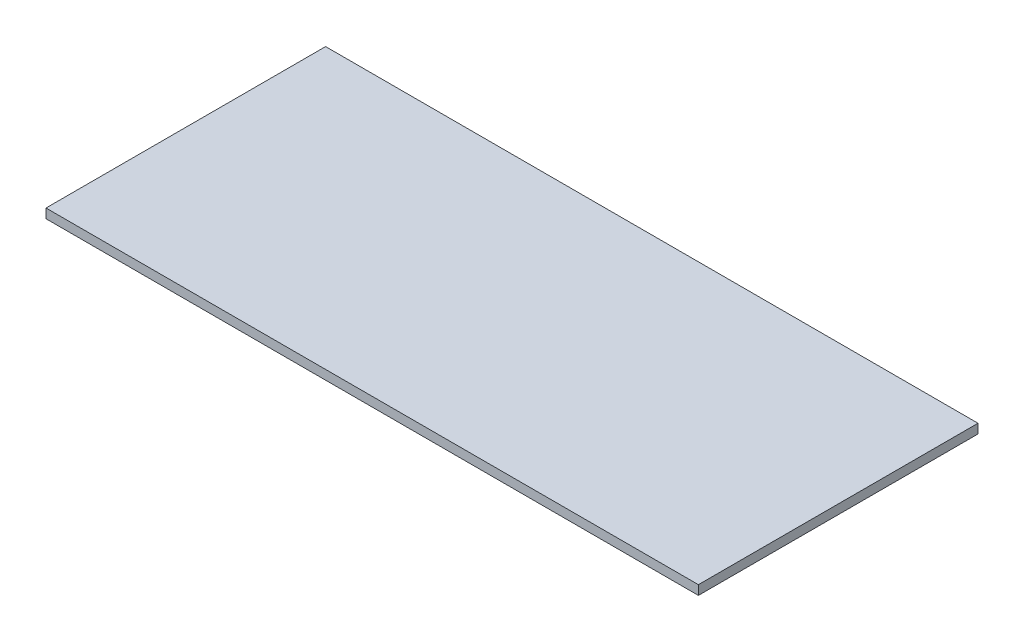
ISO-10303-21;
HEADER;
FILE_DESCRIPTION(('STEP AP214'),'2;1');
FILE_NAME('part.step','',(''),(''),'','','');
FILE_SCHEMA(('AUTOMOTIVE_DESIGN { 1 0 10303 214 1 1 1 1 }'));
ENDSEC;
DATA;
#1=APPLICATION_CONTEXT('core data for automotive mechanical design processes');
#2=APPLICATION_PROTOCOL_DEFINITION('international standard','automotive_design',2000,#1);
#3=PRODUCT_CONTEXT('',#1,'mechanical');
#4=PRODUCT('Part','Part','',(#3));
#5=PRODUCT_RELATED_PRODUCT_CATEGORY('part','',(#4));
#6=PRODUCT_DEFINITION_FORMATION('','',#4);
#7=PRODUCT_DEFINITION_CONTEXT('part definition',#1,'design');
#8=PRODUCT_DEFINITION('design','',#6,#7);
#9=PRODUCT_DEFINITION_SHAPE('','',#8);
#10=(LENGTH_UNIT() NAMED_UNIT(*) SI_UNIT(.MILLI.,.METRE.));
#11=(NAMED_UNIT(*) PLANE_ANGLE_UNIT() SI_UNIT($,.RADIAN.));
#12=(NAMED_UNIT(*) SI_UNIT($,.STERADIAN.) SOLID_ANGLE_UNIT());
#13=UNCERTAINTY_MEASURE_WITH_UNIT(LENGTH_MEASURE(1.E-05),#10,'distance_accuracy_value','');
#14=(GEOMETRIC_REPRESENTATION_CONTEXT(3) GLOBAL_UNCERTAINTY_ASSIGNED_CONTEXT((#13)) GLOBAL_UNIT_ASSIGNED_CONTEXT((#10,
#11,#12)) REPRESENTATION_CONTEXT('',''));
#15=CARTESIAN_POINT('',(0.,0.,0.));
#16=DIRECTION('',(0.,0.,1.));
#17=DIRECTION('',(1.,0.,0.));
#18=AXIS2_PLACEMENT_3D('',#15,#16,#17);
#19=CARTESIAN_POINT('',(-175.,5.,75.));
#20=DIRECTION('',(1.,0.,0.));
#21=DIRECTION('',(0.,0.,-1.));
#22=AXIS2_PLACEMENT_3D('',#19,#20,#21);
#23=PLANE('',#22);
#24=DIRECTION('',(0.,0.,1.));
#25=VECTOR('',#24,1.);
#26=CARTESIAN_POINT('',(-175.,0.,75.));
#27=LINE('',#26,#25);
#28=CARTESIAN_POINT('',(-175.,0.,-75.));
#29=VERTEX_POINT('',#28);
#30=CARTESIAN_POINT('',(-175.,0.,75.));
#31=VERTEX_POINT('',#30);
#32=EDGE_CURVE('E102',#29,#31,#27,.T.);
#33=ORIENTED_EDGE('',*,*,#32,.T.);
#34=DIRECTION('',(0.,-1.,0.));
#35=VECTOR('',#34,1.);
#36=CARTESIAN_POINT('',(-175.,5.,75.));
#37=LINE('',#36,#35);
#38=CARTESIAN_POINT('',(-175.,5.,75.));
#39=VERTEX_POINT('',#38);
#40=EDGE_CURVE('E11',#39,#31,#37,.T.);
#41=ORIENTED_EDGE('',*,*,#40,.F.);
#42=DIRECTION('',(0.,0.,1.));
#43=VECTOR('',#42,1.);
#44=CARTESIAN_POINT('',(-175.,5.,75.));
#45=LINE('',#44,#43);
#46=CARTESIAN_POINT('',(-175.,5.,-75.));
#47=VERTEX_POINT('',#46);
#48=EDGE_CURVE('E90',#47,#39,#45,.T.);
#49=ORIENTED_EDGE('',*,*,#48,.F.);
#50=DIRECTION('',(0.,-1.,0.));
#51=VECTOR('',#50,1.);
#52=CARTESIAN_POINT('',(-175.,5.,-75.));
#53=LINE('',#52,#51);
#54=EDGE_CURVE('E98',#47,#29,#53,.T.);
#55=ORIENTED_EDGE('',*,*,#54,.T.);
#56=EDGE_LOOP('',(#33,#41,#49,#55));
#57=FACE_BOUND('',#56,.T.);
#58=ADVANCED_FACE('F39',(#57),#23,.F.);
#59=CARTESIAN_POINT('',(175.,5.,75.));
#60=DIRECTION('',(0.,0.,-1.));
#61=DIRECTION('',(-1.,0.,0.));
#62=AXIS2_PLACEMENT_3D('',#59,#60,#61);
#63=PLANE('',#62);
#64=DIRECTION('',(1.,0.,0.));
#65=VECTOR('',#64,1.);
#66=CARTESIAN_POINT('',(175.,0.,75.));
#67=LINE('',#66,#65);
#68=CARTESIAN_POINT('',(175.,0.,75.));
#69=VERTEX_POINT('',#68);
#70=EDGE_CURVE('E94',#31,#69,#67,.T.);
#71=ORIENTED_EDGE('',*,*,#70,.T.);
#72=DIRECTION('',(0.,-1.,0.));
#73=VECTOR('',#72,1.);
#74=CARTESIAN_POINT('',(175.,5.,75.));
#75=LINE('',#74,#73);
#76=CARTESIAN_POINT('',(175.,5.,75.));
#77=VERTEX_POINT('',#76);
#78=EDGE_CURVE('E47',#77,#69,#75,.T.);
#79=ORIENTED_EDGE('',*,*,#78,.F.);
#80=DIRECTION('',(1.,0.,0.));
#81=VECTOR('',#80,1.);
#82=CARTESIAN_POINT('',(175.,5.,75.));
#83=LINE('',#82,#81);
#84=EDGE_CURVE('E85',#39,#77,#83,.T.);
#85=ORIENTED_EDGE('',*,*,#84,.F.);
#86=ORIENTED_EDGE('',*,*,#40,.T.);
#87=EDGE_LOOP('',(#71,#79,#85,#86));
#88=FACE_BOUND('',#87,.T.);
#89=ADVANCED_FACE('F93',(#88),#63,.F.);
#90=CARTESIAN_POINT('',(175.,5.,75.));
#91=DIRECTION('',(-1.,0.,0.));
#92=DIRECTION('',(0.,0.,1.));
#93=AXIS2_PLACEMENT_3D('',#90,#91,#92);
#94=PLANE('',#93);
#95=DIRECTION('',(0.,0.,-1.));
#96=VECTOR('',#95,1.);
#97=CARTESIAN_POINT('',(175.,0.,75.));
#98=LINE('',#97,#96);
#99=CARTESIAN_POINT('',(175.,0.,-75.));
#100=VERTEX_POINT('',#99);
#101=EDGE_CURVE('E72',#69,#100,#98,.T.);
#102=ORIENTED_EDGE('',*,*,#101,.T.);
#103=DIRECTION('',(0.,-1.,0.));
#104=VECTOR('',#103,1.);
#105=CARTESIAN_POINT('',(175.,5.,-75.));
#106=LINE('',#105,#104);
#107=CARTESIAN_POINT('',(175.,5.,-75.));
#108=VERTEX_POINT('',#107);
#109=EDGE_CURVE('E95',#108,#100,#106,.T.);
#110=ORIENTED_EDGE('',*,*,#109,.F.);
#111=DIRECTION('',(0.,0.,-1.));
#112=VECTOR('',#111,1.);
#113=CARTESIAN_POINT('',(175.,5.,75.));
#114=LINE('',#113,#112);
#115=EDGE_CURVE('E88',#77,#108,#114,.T.);
#116=ORIENTED_EDGE('',*,*,#115,.F.);
#117=ORIENTED_EDGE('',*,*,#78,.T.);
#118=EDGE_LOOP('',(#102,#110,#116,#117));
#119=FACE_BOUND('',#118,.T.);
#120=ADVANCED_FACE('F96',(#119),#94,.F.);
#121=CARTESIAN_POINT('',(175.,5.,-75.));
#122=DIRECTION('',(0.,0.,1.));
#123=DIRECTION('',(1.,0.,0.));
#124=AXIS2_PLACEMENT_3D('',#121,#122,#123);
#125=PLANE('',#124);
#126=DIRECTION('',(-1.,0.,0.));
#127=VECTOR('',#126,1.);
#128=CARTESIAN_POINT('',(175.,0.,-75.));
#129=LINE('',#128,#127);
#130=EDGE_CURVE('E78',#100,#29,#129,.T.);
#131=ORIENTED_EDGE('',*,*,#130,.T.);
#132=ORIENTED_EDGE('',*,*,#54,.F.);
#133=DIRECTION('',(-1.,0.,0.));
#134=VECTOR('',#133,1.);
#135=CARTESIAN_POINT('',(175.,5.,-75.));
#136=LINE('',#135,#134);
#137=EDGE_CURVE('E55',#108,#47,#136,.T.);
#138=ORIENTED_EDGE('',*,*,#137,.F.);
#139=ORIENTED_EDGE('',*,*,#109,.T.);
#140=EDGE_LOOP('',(#131,#132,#138,#139));
#141=FACE_BOUND('',#140,.T.);
#142=ADVANCED_FACE('F109',(#141),#125,.F.);
#143=CARTESIAN_POINT('',(0.,5.,0.));
#144=DIRECTION('',(0.,1.,0.));
#145=DIRECTION('',(0.,0.,1.));
#146=AXIS2_PLACEMENT_3D('',#143,#144,#145);
#147=PLANE('',#146);
#148=ORIENTED_EDGE('',*,*,#48,.T.);
#149=ORIENTED_EDGE('',*,*,#84,.T.);
#150=ORIENTED_EDGE('',*,*,#115,.T.);
#151=ORIENTED_EDGE('',*,*,#137,.T.);
#152=EDGE_LOOP('',(#148,#149,#150,#151));
#153=FACE_BOUND('',#152,.T.);
#154=ADVANCED_FACE('F86',(#153),#147,.T.);
#155=CARTESIAN_POINT('',(0.,0.,0.));
#156=DIRECTION('',(0.,1.,0.));
#157=DIRECTION('',(0.,0.,1.));
#158=AXIS2_PLACEMENT_3D('',#155,#156,#157);
#159=PLANE('',#158);
#160=ORIENTED_EDGE('',*,*,#32,.F.);
#161=ORIENTED_EDGE('',*,*,#130,.F.);
#162=ORIENTED_EDGE('',*,*,#101,.F.);
#163=ORIENTED_EDGE('',*,*,#70,.F.);
#164=EDGE_LOOP('',(#160,#161,#162,#163));
#165=FACE_BOUND('',#164,.T.);
#166=ADVANCED_FACE('F112',(#165),#159,.F.);
#167=CLOSED_SHELL('',(#58,#89,#120,#142,#154,#166));
#168=MANIFOLD_SOLID_BREP('B2',#167);
#169=ADVANCED_BREP_SHAPE_REPRESENTATION('',(#18,#168),#14);
#170=SHAPE_DEFINITION_REPRESENTATION(#9,#169);
ENDSEC;
END-ISO-10303-21;
